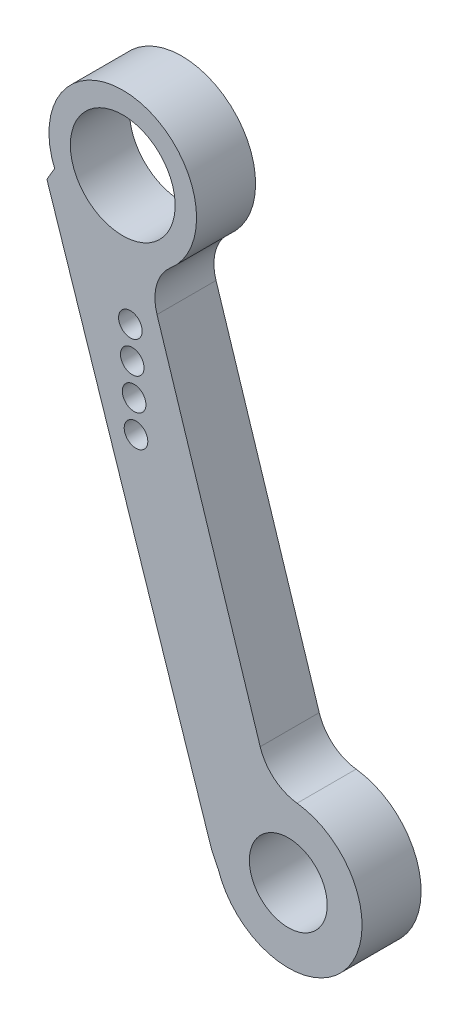
ISO-10303-21;
HEADER;
FILE_DESCRIPTION(('STEP AP214'),'2;1');
FILE_NAME('part.step','',(''),(''),'','','');
FILE_SCHEMA(('AUTOMOTIVE_DESIGN { 1 0 10303 214 1 1 1 1 }'));
ENDSEC;
DATA;
#1=APPLICATION_CONTEXT('core data for automotive mechanical design processes');
#2=APPLICATION_PROTOCOL_DEFINITION('international standard','automotive_design',2000,#1);
#3=PRODUCT_CONTEXT('',#1,'mechanical');
#4=PRODUCT('Part','Part','',(#3));
#5=PRODUCT_RELATED_PRODUCT_CATEGORY('part','',(#4));
#6=PRODUCT_DEFINITION_FORMATION('','',#4);
#7=PRODUCT_DEFINITION_CONTEXT('part definition',#1,'design');
#8=PRODUCT_DEFINITION('design','',#6,#7);
#9=PRODUCT_DEFINITION_SHAPE('','',#8);
#10=(LENGTH_UNIT() NAMED_UNIT(*) SI_UNIT(.MILLI.,.METRE.));
#11=(NAMED_UNIT(*) PLANE_ANGLE_UNIT() SI_UNIT($,.RADIAN.));
#12=(NAMED_UNIT(*) SI_UNIT($,.STERADIAN.) SOLID_ANGLE_UNIT());
#13=UNCERTAINTY_MEASURE_WITH_UNIT(LENGTH_MEASURE(1.E-05),#10,'distance_accuracy_value','');
#14=(GEOMETRIC_REPRESENTATION_CONTEXT(3) GLOBAL_UNCERTAINTY_ASSIGNED_CONTEXT((#13)) GLOBAL_UNIT_ASSIGNED_CONTEXT((#10,
#11,#12)) REPRESENTATION_CONTEXT('',''));
#15=CARTESIAN_POINT('',(0.,0.,0.));
#16=DIRECTION('',(0.,0.,1.));
#17=DIRECTION('',(1.,0.,0.));
#18=AXIS2_PLACEMENT_3D('',#15,#16,#17);
#19=CARTESIAN_POINT('',(8.97935143865251,86.4261615354982,0.));
#20=DIRECTION('',(0.,0.,1.));
#21=DIRECTION('',(1.,0.,0.));
#22=AXIS2_PLACEMENT_3D('',#19,#20,#21);
#23=CYLINDRICAL_SURFACE('',#22,4.99999999999999);
#24=CARTESIAN_POINT('',(8.97935143865251,86.4261615354982,4.));
#25=DIRECTION('',(0.,0.,1.));
#26=DIRECTION('',(1.,0.,0.));
#27=AXIS2_PLACEMENT_3D('',#24,#25,#26);
#28=CIRCLE('',#27,4.99999999999999);
#29=CARTESIAN_POINT('',(12.2155763988748,82.6147512969075,4.));
#30=VERTEX_POINT('',#29);
#31=CARTESIAN_POINT('',(4.36118664892974,84.5097706633208,4.));
#32=VERTEX_POINT('',#31);
#33=EDGE_CURVE('E129',#30,#32,#28,.T.);
#34=ORIENTED_EDGE('',*,*,#33,.F.);
#35=DIRECTION('',(0.,0.,1.));
#36=VECTOR('',#35,1.);
#37=CARTESIAN_POINT('',(12.2155763988748,82.6147512969075,0.));
#38=LINE('',#37,#36);
#39=CARTESIAN_POINT('',(12.2155763988748,82.6147512969075,0.));
#40=VERTEX_POINT('',#39);
#41=EDGE_CURVE('E11',#40,#30,#38,.T.);
#42=ORIENTED_EDGE('',*,*,#41,.F.);
#43=CARTESIAN_POINT('',(8.97935143865251,86.4261615354982,0.));
#44=DIRECTION('',(0.,0.,1.));
#45=DIRECTION('',(1.,0.,0.));
#46=AXIS2_PLACEMENT_3D('',#43,#44,#45);
#47=CIRCLE('',#46,4.99999999999999);
#48=CARTESIAN_POINT('',(4.36118664892974,84.5097706633208,0.));
#49=VERTEX_POINT('',#48);
#50=EDGE_CURVE('E150',#40,#49,#47,.T.);
#51=ORIENTED_EDGE('',*,*,#50,.T.);
#52=DIRECTION('',(0.,0.,1.));
#53=VECTOR('',#52,1.);
#54=CARTESIAN_POINT('',(4.36118664892974,84.5097706633208,0.));
#55=LINE('',#54,#53);
#56=EDGE_CURVE('E35',#49,#32,#55,.T.);
#57=ORIENTED_EDGE('',*,*,#56,.T.);
#58=EDGE_LOOP('',(#34,#42,#51,#57));
#59=FACE_BOUND('',#58,.T.);
#60=ADVANCED_FACE('F32',(#59),#23,.T.);
#61=CARTESIAN_POINT('',(14.1573113750082,80.3279051537531,0.));
#62=DIRECTION('',(0.,0.,1.));
#63=DIRECTION('',(1.,0.,0.));
#64=AXIS2_PLACEMENT_3D('',#61,#62,#63);
#65=CYLINDRICAL_SURFACE('',#64,3.00000000000001);
#66=CARTESIAN_POINT('',(14.1573113750082,80.3279051537531,4.));
#67=DIRECTION('',(0.,0.,-1.));
#68=DIRECTION('',(-1.,0.,0.));
#69=AXIS2_PLACEMENT_3D('',#66,#67,#68);
#70=CIRCLE('',#69,3.00000000000001);
#71=CARTESIAN_POINT('',(11.2998254082475,79.4142455071855,4.));
#72=VERTEX_POINT('',#71);
#73=EDGE_CURVE('E148',#72,#30,#70,.T.);
#74=ORIENTED_EDGE('',*,*,#73,.F.);
#75=DIRECTION('',(0.,0.,1.));
#76=VECTOR('',#75,1.);
#77=CARTESIAN_POINT('',(11.2998254082475,79.4142455071855,0.));
#78=LINE('',#77,#76);
#79=CARTESIAN_POINT('',(11.2998254082475,79.4142455071855,0.));
#80=VERTEX_POINT('',#79);
#81=EDGE_CURVE('E41',#80,#72,#78,.T.);
#82=ORIENTED_EDGE('',*,*,#81,.F.);
#83=CARTESIAN_POINT('',(14.1573113750082,80.3279051537531,0.));
#84=DIRECTION('',(0.,0.,-1.));
#85=DIRECTION('',(-1.,0.,0.));
#86=AXIS2_PLACEMENT_3D('',#83,#84,#85);
#87=CIRCLE('',#86,3.00000000000001);
#88=EDGE_CURVE('E119',#80,#40,#87,.T.);
#89=ORIENTED_EDGE('',*,*,#88,.T.);
#90=ORIENTED_EDGE('',*,*,#41,.T.);
#91=EDGE_LOOP('',(#74,#82,#89,#90));
#92=FACE_BOUND('',#91,.T.);
#93=ADVANCED_FACE('F162',(#92),#65,.F.);
#94=CARTESIAN_POINT('',(18.2905128783694,57.5507524450491,0.));
#95=DIRECTION('',(0.952495322253555,0.304553215522505,0.));
#96=DIRECTION('',(-0.304553215522505,0.952495322253555,0.));
#97=AXIS2_PLACEMENT_3D('',#94,#95,#96);
#98=PLANE('',#97);
#99=DIRECTION('',(-0.304553215522505,0.952495322253555,0.));
#100=VECTOR('',#99,1.);
#101=CARTESIAN_POINT('',(18.2905128783694,57.5507524450491,4.));
#102=LINE('',#101,#100);
#103=CARTESIAN_POINT('',(18.2905128783694,57.5507524450491,4.));
#104=VERTEX_POINT('',#103);
#105=EDGE_CURVE('E106',#104,#72,#102,.T.);
#106=ORIENTED_EDGE('',*,*,#105,.F.);
#107=DIRECTION('',(0.,0.,1.));
#108=VECTOR('',#107,1.);
#109=CARTESIAN_POINT('',(18.2905128783694,57.5507524450491,0.));
#110=LINE('',#109,#108);
#111=CARTESIAN_POINT('',(18.2905128783694,57.5507524450491,0.));
#112=VERTEX_POINT('',#111);
#113=EDGE_CURVE('E101',#112,#104,#110,.T.);
#114=ORIENTED_EDGE('',*,*,#113,.F.);
#115=DIRECTION('',(-0.304553215522505,0.952495322253555,0.));
#116=VECTOR('',#115,1.);
#117=CARTESIAN_POINT('',(18.2905128783694,57.5507524450491,0.));
#118=LINE('',#117,#116);
#119=EDGE_CURVE('E104',#112,#80,#118,.T.);
#120=ORIENTED_EDGE('',*,*,#119,.T.);
#121=ORIENTED_EDGE('',*,*,#81,.T.);
#122=EDGE_LOOP('',(#106,#114,#120,#121));
#123=FACE_BOUND('',#122,.T.);
#124=ADVANCED_FACE('F103',(#123),#98,.T.);
#125=CARTESIAN_POINT('',(21.1479988451301,58.4644120916165,0.));
#126=DIRECTION('',(0.,0.,1.));
#127=DIRECTION('',(1.,0.,0.));
#128=AXIS2_PLACEMENT_3D('',#125,#126,#127);
#129=CYLINDRICAL_SURFACE('',#128,3.00000000000005);
#130=CARTESIAN_POINT('',(21.1479988451301,58.4644120916165,4.));
#131=DIRECTION('',(0.,0.,-1.));
#132=DIRECTION('',(-1.,0.,0.));
#133=AXIS2_PLACEMENT_3D('',#130,#131,#132);
#134=CIRCLE('',#133,3.00000000000005);
#135=CARTESIAN_POINT('',(20.7904727789463,55.4857924260669,4.));
#136=VERTEX_POINT('',#135);
#137=EDGE_CURVE('E145',#136,#104,#134,.T.);
#138=ORIENTED_EDGE('',*,*,#137,.F.);
#139=DIRECTION('',(0.,0.,1.));
#140=VECTOR('',#139,1.);
#141=CARTESIAN_POINT('',(20.7904727789463,55.4857924260669,0.));
#142=LINE('',#141,#140);
#143=CARTESIAN_POINT('',(20.7904727789463,55.4857924260669,0.));
#144=VERTEX_POINT('',#143);
#145=EDGE_CURVE('E111',#144,#136,#142,.T.);
#146=ORIENTED_EDGE('',*,*,#145,.F.);
#147=CARTESIAN_POINT('',(21.1479988451301,58.4644120916165,0.));
#148=DIRECTION('',(0.,0.,-1.));
#149=DIRECTION('',(-1.,0.,0.));
#150=AXIS2_PLACEMENT_3D('',#147,#148,#149);
#151=CIRCLE('',#150,3.00000000000005);
#152=EDGE_CURVE('E117',#144,#112,#151,.T.);
#153=ORIENTED_EDGE('',*,*,#152,.T.);
#154=ORIENTED_EDGE('',*,*,#113,.T.);
#155=EDGE_LOOP('',(#138,#146,#153,#154));
#156=FACE_BOUND('',#155,.T.);
#157=ADVANCED_FACE('F121',(#156),#129,.F.);
#158=CARTESIAN_POINT('',(20.1945960019734,50.5214263168174,0.));
#159=DIRECTION('',(0.,0.,1.));
#160=DIRECTION('',(1.,0.,0.));
#161=AXIS2_PLACEMENT_3D('',#158,#159,#160);
#162=CYLINDRICAL_SURFACE('',#161,4.99999999999999);
#163=CARTESIAN_POINT('',(20.1945960019734,50.5214263168174,4.));
#164=DIRECTION('',(0.,0.,1.));
#165=DIRECTION('',(1.,0.,0.));
#166=AXIS2_PLACEMENT_3D('',#163,#164,#165);
#167=CIRCLE('',#166,4.99999999999999);
#168=CARTESIAN_POINT('',(15.4550916296435,48.9285991747001,4.));
#169=VERTEX_POINT('',#168);
#170=EDGE_CURVE('E142',#169,#136,#167,.T.);
#171=ORIENTED_EDGE('',*,*,#170,.F.);
#172=DIRECTION('',(0.,0.,1.));
#173=VECTOR('',#172,1.);
#174=CARTESIAN_POINT('',(15.4550916296435,48.9285991747001,0.));
#175=LINE('',#174,#173);
#176=CARTESIAN_POINT('',(15.4550916296435,48.9285991747001,0.));
#177=VERTEX_POINT('',#176);
#178=EDGE_CURVE('E154',#177,#169,#175,.T.);
#179=ORIENTED_EDGE('',*,*,#178,.F.);
#180=CARTESIAN_POINT('',(20.1945960019734,50.5214263168174,0.));
#181=DIRECTION('',(0.,0.,1.));
#182=DIRECTION('',(1.,0.,0.));
#183=AXIS2_PLACEMENT_3D('',#180,#181,#182);
#184=CIRCLE('',#183,4.99999999999999);
#185=EDGE_CURVE('E122',#177,#144,#184,.T.);
#186=ORIENTED_EDGE('',*,*,#185,.T.);
#187=ORIENTED_EDGE('',*,*,#145,.T.);
#188=EDGE_LOOP('',(#171,#179,#186,#187));
#189=FACE_BOUND('',#188,.T.);
#190=ADVANCED_FACE('F175',(#189),#162,.T.);
#191=CARTESIAN_POINT('',(15.0110533623116,49.8306623749407,0.));
#192=DIRECTION('',(-0.897192109571416,-0.441640485602025,0.));
#193=DIRECTION('',(0.441640485602025,-0.897192109571416,0.));
#194=AXIS2_PLACEMENT_3D('',#191,#192,#193);
#195=PLANE('',#194);
#196=DIRECTION('',(0.441640485602025,-0.897192109571416,0.));
#197=VECTOR('',#196,1.);
#198=CARTESIAN_POINT('',(15.0110533623116,49.8306623749407,4.));
#199=LINE('',#198,#197);
#200=CARTESIAN_POINT('',(15.0110533623116,49.8306623749407,4.));
#201=VERTEX_POINT('',#200);
#202=EDGE_CURVE('E139',#201,#169,#199,.T.);
#203=ORIENTED_EDGE('',*,*,#202,.F.);
#204=DIRECTION('',(0.,0.,1.));
#205=VECTOR('',#204,1.);
#206=CARTESIAN_POINT('',(15.0110533623116,49.8306623749407,0.));
#207=LINE('',#206,#205);
#208=CARTESIAN_POINT('',(15.0110533623116,49.8306623749407,0.));
#209=VERTEX_POINT('',#208);
#210=EDGE_CURVE('E156',#209,#201,#207,.T.);
#211=ORIENTED_EDGE('',*,*,#210,.F.);
#212=DIRECTION('',(0.441640485602025,-0.897192109571416,0.));
#213=VECTOR('',#212,1.);
#214=CARTESIAN_POINT('',(15.0110533623116,49.8306623749407,0.));
#215=LINE('',#214,#213);
#216=EDGE_CURVE('E124',#209,#177,#215,.T.);
#217=ORIENTED_EDGE('',*,*,#216,.T.);
#218=ORIENTED_EDGE('',*,*,#178,.T.);
#219=EDGE_LOOP('',(#203,#211,#217,#218));
#220=FACE_BOUND('',#219,.T.);
#221=ADVANCED_FACE('F178',(#220),#195,.T.);
#222=CARTESIAN_POINT('',(3.83869237847881,83.6229018224323,0.));
#223=DIRECTION('',(-0.949453564490203,-0.313907516438917,0.));
#224=DIRECTION('',(0.313907516438917,-0.949453564490203,0.));
#225=AXIS2_PLACEMENT_3D('',#222,#223,#224);
#226=PLANE('',#225);
#227=DIRECTION('',(0.313907516438916,-0.949453564490203,0.));
#228=VECTOR('',#227,1.);
#229=CARTESIAN_POINT('',(3.83869237847881,83.6229018224323,4.));
#230=LINE('',#229,#228);
#231=CARTESIAN_POINT('',(3.83869237847881,83.6229018224323,4.));
#232=VERTEX_POINT('',#231);
#233=EDGE_CURVE('E136',#232,#201,#230,.T.);
#234=ORIENTED_EDGE('',*,*,#233,.F.);
#235=DIRECTION('',(0.,0.,1.));
#236=VECTOR('',#235,1.);
#237=CARTESIAN_POINT('',(3.83869237847881,83.6229018224323,0.));
#238=LINE('',#237,#236);
#239=CARTESIAN_POINT('',(3.83869237847881,83.6229018224323,0.));
#240=VERTEX_POINT('',#239);
#241=EDGE_CURVE('E157',#240,#232,#238,.T.);
#242=ORIENTED_EDGE('',*,*,#241,.F.);
#243=DIRECTION('',(0.313907516438916,-0.949453564490203,0.));
#244=VECTOR('',#243,1.);
#245=CARTESIAN_POINT('',(3.83869237847881,83.6229018224323,0.));
#246=LINE('',#245,#244);
#247=EDGE_CURVE('E264',#240,#209,#246,.T.);
#248=ORIENTED_EDGE('',*,*,#247,.T.);
#249=ORIENTED_EDGE('',*,*,#210,.T.);
#250=EDGE_LOOP('',(#234,#242,#248,#249));
#251=FACE_BOUND('',#250,.T.);
#252=ADVANCED_FACE('F182',(#251),#226,.T.);
#253=CARTESIAN_POINT('',(4.36118664892974,84.5097706633208,0.));
#254=DIRECTION('',(-0.861591516947736,0.507602263513176,0.));
#255=DIRECTION('',(-0.507602263513176,-0.861591516947736,0.));
#256=AXIS2_PLACEMENT_3D('',#253,#254,#255);
#257=PLANE('',#256);
#258=DIRECTION('',(-0.507602263513176,-0.861591516947736,0.));
#259=VECTOR('',#258,1.);
#260=CARTESIAN_POINT('',(4.36118664892974,84.5097706633208,4.));
#261=LINE('',#260,#259);
#262=EDGE_CURVE('E132',#32,#232,#261,.T.);
#263=ORIENTED_EDGE('',*,*,#262,.F.);
#264=ORIENTED_EDGE('',*,*,#56,.F.);
#265=DIRECTION('',(-0.507602263513176,-0.861591516947736,0.));
#266=VECTOR('',#265,1.);
#267=CARTESIAN_POINT('',(4.36118664892974,84.5097706633208,0.));
#268=LINE('',#267,#266);
#269=EDGE_CURVE('E262',#49,#240,#268,.T.);
#270=ORIENTED_EDGE('',*,*,#269,.T.);
#271=ORIENTED_EDGE('',*,*,#241,.T.);
#272=EDGE_LOOP('',(#263,#264,#270,#271));
#273=FACE_BOUND('',#272,.T.);
#274=ADVANCED_FACE('F159',(#273),#257,.T.);
#275=CARTESIAN_POINT('',(8.97935143865251,86.4261615354982,0.));
#276=DIRECTION('',(0.,0.,1.));
#277=DIRECTION('',(1.,0.,0.));
#278=AXIS2_PLACEMENT_3D('',#275,#276,#277);
#279=PLANE('',#278);
#280=CARTESIAN_POINT('',(9.87607362016182,71.6533524143748,0.));
#281=DIRECTION('',(0.,0.,1.));
#282=DIRECTION('',(-1.,0.,0.));
#283=AXIS2_PLACEMENT_3D('',#280,#281,#282);
#284=CIRCLE('',#283,0.799999999999999);
#285=CARTESIAN_POINT('',(9.07607362016183,71.6533524143748,0.));
#286=VERTEX_POINT('',#285);
#287=EDGE_CURVE('E225',#286,#286,#284,.T.);
#288=ORIENTED_EDGE('',*,*,#287,.T.);
#289=EDGE_LOOP('',(#288));
#290=FACE_BOUND('',#289,.T.);
#291=CARTESIAN_POINT('',(9.74883601332579,73.749494249129,0.));
#292=DIRECTION('',(0.,0.,1.));
#293=DIRECTION('',(-1.,0.,0.));
#294=AXIS2_PLACEMENT_3D('',#291,#292,#293);
#295=CIRCLE('',#294,0.799999999999999);
#296=CARTESIAN_POINT('',(8.9488360133258,73.749494249129,0.));
#297=VERTEX_POINT('',#296);
#298=EDGE_CURVE('E233',#297,#297,#295,.T.);
#299=ORIENTED_EDGE('',*,*,#298,.T.);
#300=EDGE_LOOP('',(#299));
#301=FACE_BOUND('',#300,.T.);
#302=CARTESIAN_POINT('',(9.62159840648976,75.8456360838832,0.));
#303=DIRECTION('',(0.,0.,1.));
#304=DIRECTION('',(-1.,0.,0.));
#305=AXIS2_PLACEMENT_3D('',#302,#303,#304);
#306=CIRCLE('',#305,0.799999999999999);
#307=CARTESIAN_POINT('',(8.82159840648977,75.8456360838832,0.));
#308=VERTEX_POINT('',#307);
#309=EDGE_CURVE('E239',#308,#308,#306,.T.);
#310=ORIENTED_EDGE('',*,*,#309,.T.);
#311=EDGE_LOOP('',(#310));
#312=FACE_BOUND('',#311,.T.);
#313=CARTESIAN_POINT('',(9.49436079965373,77.9417779186374,0.));
#314=DIRECTION('',(0.,0.,1.));
#315=DIRECTION('',(-1.,0.,0.));
#316=AXIS2_PLACEMENT_3D('',#313,#314,#315);
#317=CIRCLE('',#316,0.799999999999999);
#318=CARTESIAN_POINT('',(8.69436079965373,77.9417779186374,0.));
#319=VERTEX_POINT('',#318);
#320=EDGE_CURVE('E245',#319,#319,#317,.T.);
#321=ORIENTED_EDGE('',*,*,#320,.T.);
#322=EDGE_LOOP('',(#321));
#323=FACE_BOUND('',#322,.T.);
#324=CARTESIAN_POINT('',(8.97935143865251,86.4261615354982,0.));
#325=DIRECTION('',(0.,0.,1.));
#326=DIRECTION('',(-1.,0.,0.));
#327=AXIS2_PLACEMENT_3D('',#324,#325,#326);
#328=CIRCLE('',#327,3.55000000000047);
#329=CARTESIAN_POINT('',(5.42935143865203,86.4261615354982,0.));
#330=VERTEX_POINT('',#329);
#331=EDGE_CURVE('E251',#330,#330,#328,.T.);
#332=ORIENTED_EDGE('',*,*,#331,.T.);
#333=EDGE_LOOP('',(#332));
#334=FACE_BOUND('',#333,.T.);
#335=CARTESIAN_POINT('',(20.1945960019734,50.5214263168174,0.));
#336=DIRECTION('',(0.,0.,1.));
#337=DIRECTION('',(-1.,0.,0.));
#338=AXIS2_PLACEMENT_3D('',#335,#336,#337);
#339=CIRCLE('',#338,2.6375);
#340=CARTESIAN_POINT('',(17.5570960019734,50.5214263168174,0.));
#341=VERTEX_POINT('',#340);
#342=EDGE_CURVE('E133',#341,#341,#339,.T.);
#343=ORIENTED_EDGE('',*,*,#342,.T.);
#344=EDGE_LOOP('',(#343));
#345=FACE_BOUND('',#344,.T.);
#346=ORIENTED_EDGE('',*,*,#50,.F.);
#347=ORIENTED_EDGE('',*,*,#88,.F.);
#348=ORIENTED_EDGE('',*,*,#119,.F.);
#349=ORIENTED_EDGE('',*,*,#152,.F.);
#350=ORIENTED_EDGE('',*,*,#185,.F.);
#351=ORIENTED_EDGE('',*,*,#216,.F.);
#352=ORIENTED_EDGE('',*,*,#247,.F.);
#353=ORIENTED_EDGE('',*,*,#269,.F.);
#354=EDGE_LOOP('',(#346,#347,#348,#349,#350,#351,#352,#353));
#355=FACE_BOUND('',#354,.T.);
#356=ADVANCED_FACE('F115',(#290,#301,#312,#323,#334,#345,#355),#279,.F.);
#357=CARTESIAN_POINT('',(8.97935143865251,86.4261615354982,4.));
#358=DIRECTION('',(0.,0.,1.));
#359=DIRECTION('',(1.,0.,0.));
#360=AXIS2_PLACEMENT_3D('',#357,#358,#359);
#361=PLANE('',#360);
#362=CARTESIAN_POINT('',(9.87607362016182,71.6533524143748,4.));
#363=DIRECTION('',(0.,0.,1.));
#364=DIRECTION('',(-1.,0.,0.));
#365=AXIS2_PLACEMENT_3D('',#362,#363,#364);
#366=CIRCLE('',#365,0.799999999999999);
#367=CARTESIAN_POINT('',(9.07607362016183,71.6533524143748,4.));
#368=VERTEX_POINT('',#367);
#369=EDGE_CURVE('E228',#368,#368,#366,.T.);
#370=ORIENTED_EDGE('',*,*,#369,.F.);
#371=EDGE_LOOP('',(#370));
#372=FACE_BOUND('',#371,.T.);
#373=CARTESIAN_POINT('',(9.74883601332579,73.749494249129,4.));
#374=DIRECTION('',(0.,0.,1.));
#375=DIRECTION('',(-1.,0.,0.));
#376=AXIS2_PLACEMENT_3D('',#373,#374,#375);
#377=CIRCLE('',#376,0.799999999999999);
#378=CARTESIAN_POINT('',(8.9488360133258,73.749494249129,4.));
#379=VERTEX_POINT('',#378);
#380=EDGE_CURVE('E230',#379,#379,#377,.T.);
#381=ORIENTED_EDGE('',*,*,#380,.F.);
#382=EDGE_LOOP('',(#381));
#383=FACE_BOUND('',#382,.T.);
#384=CARTESIAN_POINT('',(9.62159840648976,75.8456360838832,4.));
#385=DIRECTION('',(0.,0.,1.));
#386=DIRECTION('',(-1.,0.,0.));
#387=AXIS2_PLACEMENT_3D('',#384,#385,#386);
#388=CIRCLE('',#387,0.799999999999999);
#389=CARTESIAN_POINT('',(8.82159840648977,75.8456360838832,4.));
#390=VERTEX_POINT('',#389);
#391=EDGE_CURVE('E236',#390,#390,#388,.T.);
#392=ORIENTED_EDGE('',*,*,#391,.F.);
#393=EDGE_LOOP('',(#392));
#394=FACE_BOUND('',#393,.T.);
#395=CARTESIAN_POINT('',(9.49436079965373,77.9417779186374,4.));
#396=DIRECTION('',(0.,0.,1.));
#397=DIRECTION('',(-1.,0.,0.));
#398=AXIS2_PLACEMENT_3D('',#395,#396,#397);
#399=CIRCLE('',#398,0.799999999999999);
#400=CARTESIAN_POINT('',(8.69436079965373,77.9417779186374,4.));
#401=VERTEX_POINT('',#400);
#402=EDGE_CURVE('E242',#401,#401,#399,.T.);
#403=ORIENTED_EDGE('',*,*,#402,.F.);
#404=EDGE_LOOP('',(#403));
#405=FACE_BOUND('',#404,.T.);
#406=CARTESIAN_POINT('',(8.97935143865251,86.4261615354982,4.));
#407=DIRECTION('',(0.,0.,1.));
#408=DIRECTION('',(-1.,0.,0.));
#409=AXIS2_PLACEMENT_3D('',#406,#407,#408);
#410=CIRCLE('',#409,3.55000000000047);
#411=CARTESIAN_POINT('',(5.42935143865203,86.4261615354982,4.));
#412=VERTEX_POINT('',#411);
#413=EDGE_CURVE('E248',#412,#412,#410,.T.);
#414=ORIENTED_EDGE('',*,*,#413,.F.);
#415=EDGE_LOOP('',(#414));
#416=FACE_BOUND('',#415,.T.);
#417=CARTESIAN_POINT('',(20.1945960019734,50.5214263168174,4.));
#418=DIRECTION('',(0.,0.,1.));
#419=DIRECTION('',(-1.,0.,0.));
#420=AXIS2_PLACEMENT_3D('',#417,#418,#419);
#421=CIRCLE('',#420,2.6375);
#422=CARTESIAN_POINT('',(17.5570960019734,50.5214263168174,4.));
#423=VERTEX_POINT('',#422);
#424=EDGE_CURVE('E254',#423,#423,#421,.T.);
#425=ORIENTED_EDGE('',*,*,#424,.F.);
#426=EDGE_LOOP('',(#425));
#427=FACE_BOUND('',#426,.T.);
#428=ORIENTED_EDGE('',*,*,#33,.T.);
#429=ORIENTED_EDGE('',*,*,#262,.T.);
#430=ORIENTED_EDGE('',*,*,#233,.T.);
#431=ORIENTED_EDGE('',*,*,#202,.T.);
#432=ORIENTED_EDGE('',*,*,#170,.T.);
#433=ORIENTED_EDGE('',*,*,#137,.T.);
#434=ORIENTED_EDGE('',*,*,#105,.T.);
#435=ORIENTED_EDGE('',*,*,#73,.T.);
#436=EDGE_LOOP('',(#428,#429,#430,#431,#432,#433,#434,#435));
#437=FACE_BOUND('',#436,.T.);
#438=ADVANCED_FACE('F161',(#372,#383,#394,#405,#416,#427,#437),#361,.T.);
#439=CARTESIAN_POINT('',(20.1945960019734,50.5214263168174,0.));
#440=DIRECTION('',(0.,0.,1.));
#441=DIRECTION('',(1.,0.,0.));
#442=AXIS2_PLACEMENT_3D('',#439,#440,#441);
#443=CYLINDRICAL_SURFACE('',#442,2.6375);
#444=ORIENTED_EDGE('',*,*,#342,.F.);
#445=EDGE_LOOP('',(#444));
#446=FACE_BOUND('',#445,.T.);
#447=ORIENTED_EDGE('',*,*,#424,.T.);
#448=EDGE_LOOP('',(#447));
#449=FACE_BOUND('',#448,.T.);
#450=ADVANCED_FACE('F194',(#446,#449),#443,.F.);
#451=CARTESIAN_POINT('',(8.97935143865251,86.4261615354982,0.));
#452=DIRECTION('',(0.,0.,1.));
#453=DIRECTION('',(1.,0.,0.));
#454=AXIS2_PLACEMENT_3D('',#451,#452,#453);
#455=CYLINDRICAL_SURFACE('',#454,3.55000000000047);
#456=ORIENTED_EDGE('',*,*,#331,.F.);
#457=EDGE_LOOP('',(#456));
#458=FACE_BOUND('',#457,.T.);
#459=ORIENTED_EDGE('',*,*,#413,.T.);
#460=EDGE_LOOP('',(#459));
#461=FACE_BOUND('',#460,.T.);
#462=ADVANCED_FACE('F201',(#458,#461),#455,.F.);
#463=CARTESIAN_POINT('',(9.49436079965373,77.9417779186374,0.));
#464=DIRECTION('',(0.,0.,1.));
#465=DIRECTION('',(1.,0.,0.));
#466=AXIS2_PLACEMENT_3D('',#463,#464,#465);
#467=CYLINDRICAL_SURFACE('',#466,0.799999999999999);
#468=ORIENTED_EDGE('',*,*,#320,.F.);
#469=EDGE_LOOP('',(#468));
#470=FACE_BOUND('',#469,.T.);
#471=ORIENTED_EDGE('',*,*,#402,.T.);
#472=EDGE_LOOP('',(#471));
#473=FACE_BOUND('',#472,.T.);
#474=ADVANCED_FACE('F205',(#470,#473),#467,.F.);
#475=CARTESIAN_POINT('',(9.62159840648976,75.8456360838832,0.));
#476=DIRECTION('',(0.,0.,1.));
#477=DIRECTION('',(1.,0.,0.));
#478=AXIS2_PLACEMENT_3D('',#475,#476,#477);
#479=CYLINDRICAL_SURFACE('',#478,0.799999999999999);
#480=ORIENTED_EDGE('',*,*,#309,.F.);
#481=EDGE_LOOP('',(#480));
#482=FACE_BOUND('',#481,.T.);
#483=ORIENTED_EDGE('',*,*,#391,.T.);
#484=EDGE_LOOP('',(#483));
#485=FACE_BOUND('',#484,.T.);
#486=ADVANCED_FACE('F209',(#482,#485),#479,.F.);
#487=CARTESIAN_POINT('',(9.74883601332579,73.749494249129,0.));
#488=DIRECTION('',(0.,0.,1.));
#489=DIRECTION('',(1.,0.,0.));
#490=AXIS2_PLACEMENT_3D('',#487,#488,#489);
#491=CYLINDRICAL_SURFACE('',#490,0.799999999999999);
#492=ORIENTED_EDGE('',*,*,#298,.F.);
#493=EDGE_LOOP('',(#492));
#494=FACE_BOUND('',#493,.T.);
#495=ORIENTED_EDGE('',*,*,#380,.T.);
#496=EDGE_LOOP('',(#495));
#497=FACE_BOUND('',#496,.T.);
#498=ADVANCED_FACE('F213',(#494,#497),#491,.F.);
#499=CARTESIAN_POINT('',(9.87607362016182,71.6533524143748,0.));
#500=DIRECTION('',(0.,0.,1.));
#501=DIRECTION('',(1.,0.,0.));
#502=AXIS2_PLACEMENT_3D('',#499,#500,#501);
#503=CYLINDRICAL_SURFACE('',#502,0.799999999999999);
#504=ORIENTED_EDGE('',*,*,#287,.F.);
#505=EDGE_LOOP('',(#504));
#506=FACE_BOUND('',#505,.T.);
#507=ORIENTED_EDGE('',*,*,#369,.T.);
#508=EDGE_LOOP('',(#507));
#509=FACE_BOUND('',#508,.T.);
#510=ADVANCED_FACE('F217',(#506,#509),#503,.F.);
#511=CLOSED_SHELL('',(#60,#93,#124,#157,#190,#221,#252,#274,#356,#438,#450,#462,#474,#486,#498,#510));
#512=MANIFOLD_SOLID_BREP('B2',#511);
#513=ADVANCED_BREP_SHAPE_REPRESENTATION('',(#18,#512),#14);
#514=SHAPE_DEFINITION_REPRESENTATION(#9,#513);
ENDSEC;
END-ISO-10303-21;
